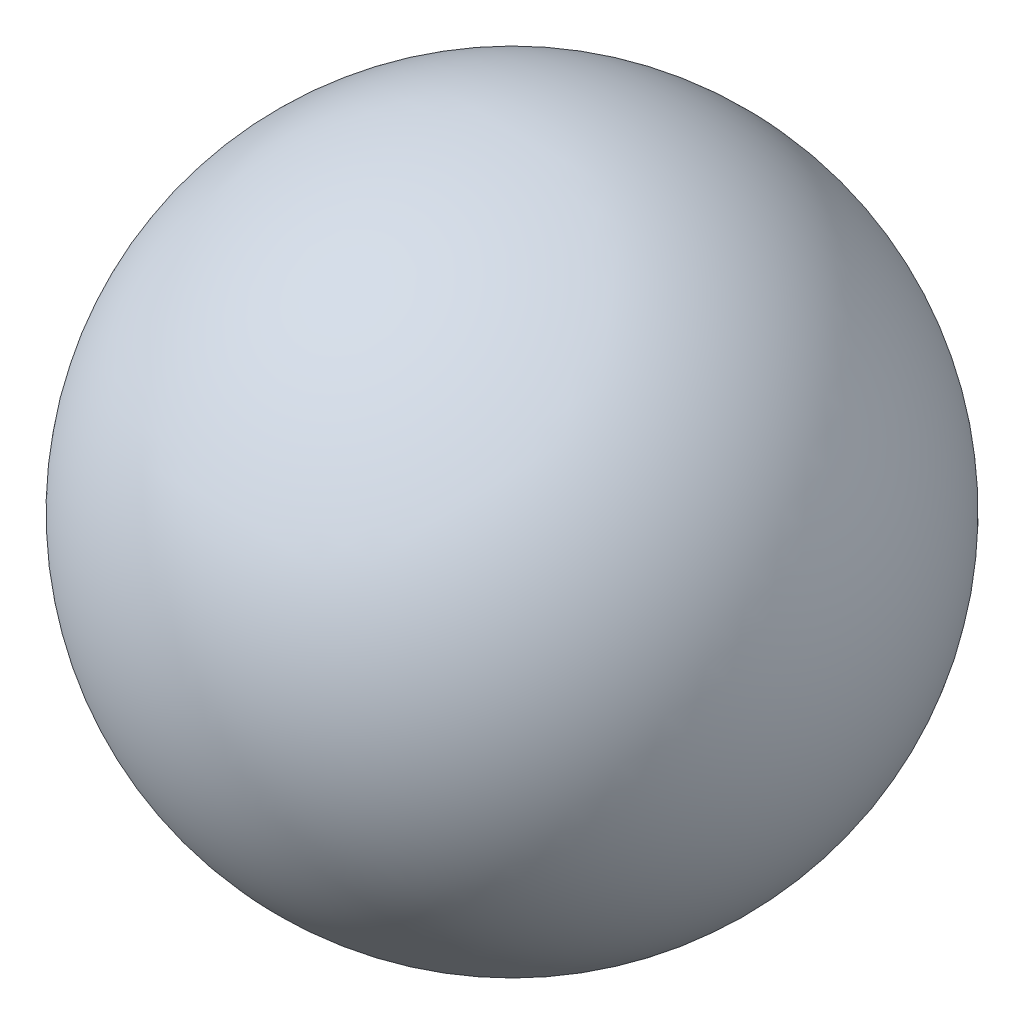
ISO-10303-21;
HEADER;
FILE_DESCRIPTION(('STEP AP214'),'2;1');
FILE_NAME('part.step','',(''),(''),'','','');
FILE_SCHEMA(('AUTOMOTIVE_DESIGN { 1 0 10303 214 1 1 1 1 }'));
ENDSEC;
DATA;
#1=APPLICATION_CONTEXT('core data for automotive mechanical design processes');
#2=APPLICATION_PROTOCOL_DEFINITION('international standard','automotive_design',2000,#1);
#3=PRODUCT_CONTEXT('',#1,'mechanical');
#4=PRODUCT('Part','Part','',(#3));
#5=PRODUCT_RELATED_PRODUCT_CATEGORY('part','',(#4));
#6=PRODUCT_DEFINITION_FORMATION('','',#4);
#7=PRODUCT_DEFINITION_CONTEXT('part definition',#1,'design');
#8=PRODUCT_DEFINITION('design','',#6,#7);
#9=PRODUCT_DEFINITION_SHAPE('','',#8);
#10=(LENGTH_UNIT() NAMED_UNIT(*) SI_UNIT(.MILLI.,.METRE.));
#11=(NAMED_UNIT(*) PLANE_ANGLE_UNIT() SI_UNIT($,.RADIAN.));
#12=(NAMED_UNIT(*) SI_UNIT($,.STERADIAN.) SOLID_ANGLE_UNIT());
#13=UNCERTAINTY_MEASURE_WITH_UNIT(LENGTH_MEASURE(1.E-05),#10,'distance_accuracy_value','');
#14=(GEOMETRIC_REPRESENTATION_CONTEXT(3) GLOBAL_UNCERTAINTY_ASSIGNED_CONTEXT((#13)) GLOBAL_UNIT_ASSIGNED_CONTEXT((#10,
#11,#12)) REPRESENTATION_CONTEXT('',''));
#15=CARTESIAN_POINT('',(0.,0.,0.));
#16=DIRECTION('',(0.,0.,1.));
#17=DIRECTION('',(1.,0.,0.));
#18=AXIS2_PLACEMENT_3D('',#15,#16,#17);
#19=CARTESIAN_POINT('',(64.16,-44.2547799821013,53.4370202924508));
#20=DIRECTION('',(0.,-0.637833186545712,0.770174542646628));
#21=DIRECTION('',(0.173648177666934,-0.758473860771031,-0.628143067238699));
#22=AXIS2_PLACEMENT_3D('',#19,#20,#21);
#23=SPHERICAL_SURFACE('',#22,7.15);
#24=CARTESIAN_POINT('',(64.16,-39.6942726982995,47.9302723125274));
#25=VERTEX_POINT('',#24);
#26=VERTEX_LOOP('',#25);
#27=FACE_BOUND('',#26,.T.);
#28=CARTESIAN_POINT('',(64.16,-48.8152872659031,58.9437682723742));
#29=VERTEX_POINT('',#28);
#30=VERTEX_LOOP('',#29);
#31=FACE_BOUND('',#30,.T.);
#32=ADVANCED_FACE('F15',(#27,#31),#23,.T.);
#33=CLOSED_SHELL('',(#32));
#34=MANIFOLD_SOLID_BREP('B1',#33);
#35=ADVANCED_BREP_SHAPE_REPRESENTATION('',(#18,#34),#14);
#36=SHAPE_DEFINITION_REPRESENTATION(#9,#35);
ENDSEC;
END-ISO-10303-21;
